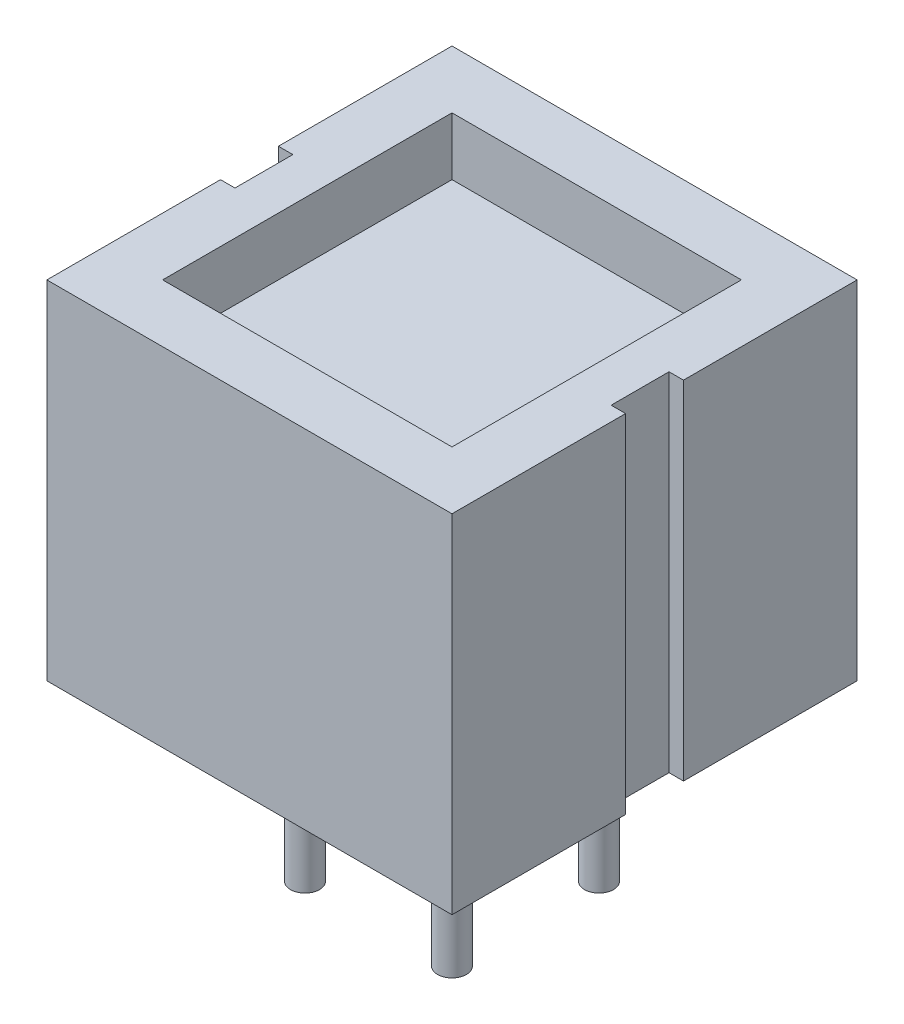
ISO-10303-21;
HEADER;
FILE_DESCRIPTION(('STEP AP214'),'2;1');
FILE_NAME('part.step','',(''),(''),'','','');
FILE_SCHEMA(('AUTOMOTIVE_DESIGN { 1 0 10303 214 1 1 1 1 }'));
ENDSEC;
DATA;
#1=APPLICATION_CONTEXT('core data for automotive mechanical design processes');
#2=APPLICATION_PROTOCOL_DEFINITION('international standard','automotive_design',2000,#1);
#3=PRODUCT_CONTEXT('',#1,'mechanical');
#4=PRODUCT('Part','Part','',(#3));
#5=PRODUCT_RELATED_PRODUCT_CATEGORY('part','',(#4));
#6=PRODUCT_DEFINITION_FORMATION('','',#4);
#7=PRODUCT_DEFINITION_CONTEXT('part definition',#1,'design');
#8=PRODUCT_DEFINITION('design','',#6,#7);
#9=PRODUCT_DEFINITION_SHAPE('','',#8);
#10=(LENGTH_UNIT() NAMED_UNIT(*) SI_UNIT(.MILLI.,.METRE.));
#11=(NAMED_UNIT(*) PLANE_ANGLE_UNIT() SI_UNIT($,.RADIAN.));
#12=(NAMED_UNIT(*) SI_UNIT($,.STERADIAN.) SOLID_ANGLE_UNIT());
#13=UNCERTAINTY_MEASURE_WITH_UNIT(LENGTH_MEASURE(1.E-05),#10,'distance_accuracy_value','');
#14=(GEOMETRIC_REPRESENTATION_CONTEXT(3) GLOBAL_UNCERTAINTY_ASSIGNED_CONTEXT((#13)) GLOBAL_UNIT_ASSIGNED_CONTEXT((#10,
#11,#12)) REPRESENTATION_CONTEXT('',''));
#15=CARTESIAN_POINT('',(0.,0.,0.));
#16=DIRECTION('',(0.,0.,1.));
#17=DIRECTION('',(1.,0.,0.));
#18=AXIS2_PLACEMENT_3D('',#15,#16,#17);
#19=CARTESIAN_POINT('',(3.5,6.,3.5));
#20=DIRECTION('',(-1.,0.,0.));
#21=DIRECTION('',(0.,0.,1.));
#22=AXIS2_PLACEMENT_3D('',#19,#20,#21);
#23=PLANE('',#22);
#24=DIRECTION('',(0.,0.,-1.));
#25=VECTOR('',#24,1.);
#26=CARTESIAN_POINT('',(3.5,6.,3.5));
#27=LINE('',#26,#25);
#28=CARTESIAN_POINT('',(3.5,6.,-0.5));
#29=VERTEX_POINT('',#28);
#30=CARTESIAN_POINT('',(3.5,6.,-3.5));
#31=VERTEX_POINT('',#30);
#32=EDGE_CURVE('E248',#29,#31,#27,.T.);
#33=ORIENTED_EDGE('',*,*,#32,.F.);
#34=DIRECTION('',(0.,-1.,0.));
#35=VECTOR('',#34,1.);
#36=CARTESIAN_POINT('',(3.5,6.,-0.5));
#37=LINE('',#36,#35);
#38=CARTESIAN_POINT('',(3.5,0.,-0.5));
#39=VERTEX_POINT('',#38);
#40=EDGE_CURVE('E186',#29,#39,#37,.T.);
#41=ORIENTED_EDGE('',*,*,#40,.T.);
#42=DIRECTION('',(0.,0.,-1.));
#43=VECTOR('',#42,1.);
#44=CARTESIAN_POINT('',(3.5,0.,3.5));
#45=LINE('',#44,#43);
#46=CARTESIAN_POINT('',(3.5,0.,-3.5));
#47=VERTEX_POINT('',#46);
#48=EDGE_CURVE('E243',#39,#47,#45,.T.);
#49=ORIENTED_EDGE('',*,*,#48,.T.);
#50=DIRECTION('',(0.,-1.,0.));
#51=VECTOR('',#50,1.);
#52=CARTESIAN_POINT('',(3.5,6.,-3.5));
#53=LINE('',#52,#51);
#54=EDGE_CURVE('E276',#31,#47,#53,.T.);
#55=ORIENTED_EDGE('',*,*,#54,.F.);
#56=EDGE_LOOP('',(#33,#41,#49,#55));
#57=FACE_BOUND('',#56,.T.);
#58=ADVANCED_FACE('F32',(#57),#23,.F.);
#59=CARTESIAN_POINT('',(-3.5,6.,3.5));
#60=DIRECTION('',(1.,0.,0.));
#61=DIRECTION('',(0.,0.,-1.));
#62=AXIS2_PLACEMENT_3D('',#59,#60,#61);
#63=PLANE('',#62);
#64=DIRECTION('',(0.,0.,1.));
#65=VECTOR('',#64,1.);
#66=CARTESIAN_POINT('',(-3.5,0.,3.5));
#67=LINE('',#66,#65);
#68=CARTESIAN_POINT('',(-3.5,0.,-3.5));
#69=VERTEX_POINT('',#68);
#70=CARTESIAN_POINT('',(-3.5,0.,-0.5));
#71=VERTEX_POINT('',#70);
#72=EDGE_CURVE('E263',#69,#71,#67,.T.);
#73=ORIENTED_EDGE('',*,*,#72,.T.);
#74=DIRECTION('',(0.,1.,0.));
#75=VECTOR('',#74,1.);
#76=CARTESIAN_POINT('',(-3.5,6.,-0.5));
#77=LINE('',#76,#75);
#78=CARTESIAN_POINT('',(-3.5,6.,-0.5));
#79=VERTEX_POINT('',#78);
#80=EDGE_CURVE('E182',#71,#79,#77,.T.);
#81=ORIENTED_EDGE('',*,*,#80,.T.);
#82=DIRECTION('',(0.,0.,1.));
#83=VECTOR('',#82,1.);
#84=CARTESIAN_POINT('',(-3.5,6.,3.5));
#85=LINE('',#84,#83);
#86=CARTESIAN_POINT('',(-3.5,6.,-3.5));
#87=VERTEX_POINT('',#86);
#88=EDGE_CURVE('E251',#87,#79,#85,.T.);
#89=ORIENTED_EDGE('',*,*,#88,.F.);
#90=DIRECTION('',(0.,-1.,0.));
#91=VECTOR('',#90,1.);
#92=CARTESIAN_POINT('',(-3.5,6.,-3.5));
#93=LINE('',#92,#91);
#94=EDGE_CURVE('E273',#87,#69,#93,.T.);
#95=ORIENTED_EDGE('',*,*,#94,.T.);
#96=EDGE_LOOP('',(#73,#81,#89,#95));
#97=FACE_BOUND('',#96,.T.);
#98=ADVANCED_FACE('F303',(#97),#63,.F.);
#99=CARTESIAN_POINT('',(3.5,0.,3.5));
#100=VERTEX_POINT('',#99);
#101=CARTESIAN_POINT('',(3.5,0.,0.5));
#102=VERTEX_POINT('',#101);
#103=EDGE_CURVE('E257',#100,#102,#45,.T.);
#104=ORIENTED_EDGE('',*,*,#103,.T.);
#105=DIRECTION('',(0.,1.,0.));
#106=VECTOR('',#105,1.);
#107=CARTESIAN_POINT('',(3.5,6.,0.5));
#108=LINE('',#107,#106);
#109=CARTESIAN_POINT('',(3.5,6.,0.5));
#110=VERTEX_POINT('',#109);
#111=EDGE_CURVE('E55',#102,#110,#108,.T.);
#112=ORIENTED_EDGE('',*,*,#111,.T.);
#113=CARTESIAN_POINT('',(3.5,6.,3.5));
#114=VERTEX_POINT('',#113);
#115=EDGE_CURVE('E165',#114,#110,#27,.T.);
#116=ORIENTED_EDGE('',*,*,#115,.F.);
#117=DIRECTION('',(0.,-1.,0.));
#118=VECTOR('',#117,1.);
#119=CARTESIAN_POINT('',(3.5,6.,3.5));
#120=LINE('',#119,#118);
#121=EDGE_CURVE('E256',#114,#100,#120,.T.);
#122=ORIENTED_EDGE('',*,*,#121,.T.);
#123=EDGE_LOOP('',(#104,#112,#116,#122));
#124=FACE_BOUND('',#123,.T.);
#125=ADVANCED_FACE('F34',(#124),#23,.F.);
#126=CARTESIAN_POINT('',(-3.5,6.,-3.5));
#127=DIRECTION('',(0.,0.,1.));
#128=DIRECTION('',(1.,0.,0.));
#129=AXIS2_PLACEMENT_3D('',#126,#127,#128);
#130=PLANE('',#129);
#131=DIRECTION('',(-1.,0.,0.));
#132=VECTOR('',#131,1.);
#133=CARTESIAN_POINT('',(-3.5,0.,-3.5));
#134=LINE('',#133,#132);
#135=EDGE_CURVE('E260',#47,#69,#134,.T.);
#136=ORIENTED_EDGE('',*,*,#135,.T.);
#137=ORIENTED_EDGE('',*,*,#94,.F.);
#138=DIRECTION('',(-1.,0.,0.));
#139=VECTOR('',#138,1.);
#140=CARTESIAN_POINT('',(-3.5,6.,-3.5));
#141=LINE('',#140,#139);
#142=EDGE_CURVE('E247',#31,#87,#141,.T.);
#143=ORIENTED_EDGE('',*,*,#142,.F.);
#144=ORIENTED_EDGE('',*,*,#54,.T.);
#145=EDGE_LOOP('',(#136,#137,#143,#144));
#146=FACE_BOUND('',#145,.T.);
#147=ADVANCED_FACE('F300',(#146),#130,.F.);
#148=CARTESIAN_POINT('',(-3.5,6.,0.5));
#149=VERTEX_POINT('',#148);
#150=CARTESIAN_POINT('',(-3.5,6.,3.5));
#151=VERTEX_POINT('',#150);
#152=EDGE_CURVE('E250',#149,#151,#85,.T.);
#153=ORIENTED_EDGE('',*,*,#152,.F.);
#154=DIRECTION('',(0.,-1.,0.));
#155=VECTOR('',#154,1.);
#156=CARTESIAN_POINT('',(-3.5,6.,0.5));
#157=LINE('',#156,#155);
#158=CARTESIAN_POINT('',(-3.5,0.,0.5));
#159=VERTEX_POINT('',#158);
#160=EDGE_CURVE('E169',#149,#159,#157,.T.);
#161=ORIENTED_EDGE('',*,*,#160,.T.);
#162=CARTESIAN_POINT('',(-3.5,0.,3.5));
#163=VERTEX_POINT('',#162);
#164=EDGE_CURVE('E262',#159,#163,#67,.T.);
#165=ORIENTED_EDGE('',*,*,#164,.T.);
#166=DIRECTION('',(0.,-1.,0.));
#167=VECTOR('',#166,1.);
#168=CARTESIAN_POINT('',(-3.5,6.,3.5));
#169=LINE('',#168,#167);
#170=EDGE_CURVE('E270',#151,#163,#169,.T.);
#171=ORIENTED_EDGE('',*,*,#170,.F.);
#172=EDGE_LOOP('',(#153,#161,#165,#171));
#173=FACE_BOUND('',#172,.T.);
#174=ADVANCED_FACE('F319',(#173),#63,.F.);
#175=CARTESIAN_POINT('',(-3.5,6.,3.5));
#176=DIRECTION('',(0.,0.,-1.));
#177=DIRECTION('',(-1.,0.,0.));
#178=AXIS2_PLACEMENT_3D('',#175,#176,#177);
#179=PLANE('',#178);
#180=DIRECTION('',(1.,0.,0.));
#181=VECTOR('',#180,1.);
#182=CARTESIAN_POINT('',(-3.5,0.,3.5));
#183=LINE('',#182,#181);
#184=EDGE_CURVE('E266',#163,#100,#183,.T.);
#185=ORIENTED_EDGE('',*,*,#184,.T.);
#186=ORIENTED_EDGE('',*,*,#121,.F.);
#187=DIRECTION('',(1.,0.,0.));
#188=VECTOR('',#187,1.);
#189=CARTESIAN_POINT('',(-3.5,6.,3.5));
#190=LINE('',#189,#188);
#191=EDGE_CURVE('E254',#151,#114,#190,.T.);
#192=ORIENTED_EDGE('',*,*,#191,.F.);
#193=ORIENTED_EDGE('',*,*,#170,.T.);
#194=EDGE_LOOP('',(#185,#186,#192,#193));
#195=FACE_BOUND('',#194,.T.);
#196=ADVANCED_FACE('F325',(#195),#179,.F.);
#197=CARTESIAN_POINT('',(0.,6.,0.));
#198=DIRECTION('',(0.,-1.,0.));
#199=DIRECTION('',(0.,0.,-1.));
#200=AXIS2_PLACEMENT_3D('',#197,#198,#199);
#201=PLANE('',#200);
#202=DIRECTION('',(-1.,0.,0.));
#203=VECTOR('',#202,1.);
#204=CARTESIAN_POINT('',(-2.5,6.,-2.5));
#205=LINE('',#204,#203);
#206=CARTESIAN_POINT('',(2.5,6.,-2.5));
#207=VERTEX_POINT('',#206);
#208=CARTESIAN_POINT('',(-2.5,6.,-2.5));
#209=VERTEX_POINT('',#208);
#210=EDGE_CURVE('E205',#207,#209,#205,.T.);
#211=ORIENTED_EDGE('',*,*,#210,.F.);
#212=DIRECTION('',(0.,0.,-1.));
#213=VECTOR('',#212,1.);
#214=CARTESIAN_POINT('',(2.5,6.,2.5));
#215=LINE('',#214,#213);
#216=CARTESIAN_POINT('',(2.5,6.,2.5));
#217=VERTEX_POINT('',#216);
#218=EDGE_CURVE('E189',#217,#207,#215,.T.);
#219=ORIENTED_EDGE('',*,*,#218,.F.);
#220=DIRECTION('',(1.,0.,0.));
#221=VECTOR('',#220,1.);
#222=CARTESIAN_POINT('',(-2.5,6.,2.5));
#223=LINE('',#222,#221);
#224=CARTESIAN_POINT('',(-2.5,6.,2.5));
#225=VERTEX_POINT('',#224);
#226=EDGE_CURVE('E194',#225,#217,#223,.T.);
#227=ORIENTED_EDGE('',*,*,#226,.F.);
#228=DIRECTION('',(0.,0.,1.));
#229=VECTOR('',#228,1.);
#230=CARTESIAN_POINT('',(-2.5,6.,2.5));
#231=LINE('',#230,#229);
#232=EDGE_CURVE('E208',#209,#225,#231,.T.);
#233=ORIENTED_EDGE('',*,*,#232,.F.);
#234=EDGE_LOOP('',(#211,#219,#227,#233));
#235=FACE_BOUND('',#234,.T.);
#236=DIRECTION('',(0.,0.,1.));
#237=VECTOR('',#236,1.);
#238=CARTESIAN_POINT('',(3.25,6.,0.5));
#239=LINE('',#238,#237);
#240=CARTESIAN_POINT('',(3.25,6.,-0.5));
#241=VERTEX_POINT('',#240);
#242=CARTESIAN_POINT('',(3.25,6.,0.5));
#243=VERTEX_POINT('',#242);
#244=EDGE_CURVE('E154',#241,#243,#239,.T.);
#245=ORIENTED_EDGE('',*,*,#244,.F.);
#246=DIRECTION('',(-1.,0.,0.));
#247=VECTOR('',#246,1.);
#248=CARTESIAN_POINT('',(3.75,6.,-0.5));
#249=LINE('',#248,#247);
#250=EDGE_CURVE('E151',#29,#241,#249,.T.);
#251=ORIENTED_EDGE('',*,*,#250,.F.);
#252=ORIENTED_EDGE('',*,*,#32,.T.);
#253=ORIENTED_EDGE('',*,*,#142,.T.);
#254=ORIENTED_EDGE('',*,*,#88,.T.);
#255=DIRECTION('',(-1.,0.,0.));
#256=VECTOR('',#255,1.);
#257=CARTESIAN_POINT('',(-3.75,6.,-0.5));
#258=LINE('',#257,#256);
#259=CARTESIAN_POINT('',(-3.25,6.,-0.5));
#260=VERTEX_POINT('',#259);
#261=EDGE_CURVE('E176',#260,#79,#258,.T.);
#262=ORIENTED_EDGE('',*,*,#261,.F.);
#263=DIRECTION('',(0.,0.,-1.));
#264=VECTOR('',#263,1.);
#265=CARTESIAN_POINT('',(-3.25,6.,0.5));
#266=LINE('',#265,#264);
#267=CARTESIAN_POINT('',(-3.25,6.,0.5));
#268=VERTEX_POINT('',#267);
#269=EDGE_CURVE('E173',#268,#260,#266,.T.);
#270=ORIENTED_EDGE('',*,*,#269,.F.);
#271=DIRECTION('',(1.,0.,0.));
#272=VECTOR('',#271,1.);
#273=CARTESIAN_POINT('',(-3.75,6.,0.5));
#274=LINE('',#273,#272);
#275=EDGE_CURVE('E171',#149,#268,#274,.T.);
#276=ORIENTED_EDGE('',*,*,#275,.F.);
#277=ORIENTED_EDGE('',*,*,#152,.T.);
#278=ORIENTED_EDGE('',*,*,#191,.T.);
#279=ORIENTED_EDGE('',*,*,#115,.T.);
#280=DIRECTION('',(1.,0.,0.));
#281=VECTOR('',#280,1.);
#282=CARTESIAN_POINT('',(3.75,6.,0.5));
#283=LINE('',#282,#281);
#284=EDGE_CURVE('E146',#243,#110,#283,.T.);
#285=ORIENTED_EDGE('',*,*,#284,.F.);
#286=EDGE_LOOP('',(#245,#251,#252,#253,#254,#262,#270,#276,#277,#278,#279,#285));
#287=FACE_BOUND('',#286,.T.);
#288=ADVANCED_FACE('F163',(#235,#287),#201,.F.);
#289=CARTESIAN_POINT('',(0.,0.,0.));
#290=DIRECTION('',(0.,-1.,0.));
#291=DIRECTION('',(0.,0.,-1.));
#292=AXIS2_PLACEMENT_3D('',#289,#290,#291);
#293=PLANE('',#292);
#294=DIRECTION('',(1.,0.,0.));
#295=VECTOR('',#294,1.);
#296=CARTESIAN_POINT('',(0.,0.,-0.499999999999999));
#297=LINE('',#296,#295);
#298=CARTESIAN_POINT('',(3.25,0.,-0.5));
#299=VERTEX_POINT('',#298);
#300=EDGE_CURVE('E11',#299,#39,#297,.T.);
#301=ORIENTED_EDGE('',*,*,#300,.F.);
#302=DIRECTION('',(0.,0.,-1.));
#303=VECTOR('',#302,1.);
#304=CARTESIAN_POINT('',(3.25,0.,0.));
#305=LINE('',#304,#303);
#306=CARTESIAN_POINT('',(3.25,0.,0.5));
#307=VERTEX_POINT('',#306);
#308=EDGE_CURVE('E40',#307,#299,#305,.T.);
#309=ORIENTED_EDGE('',*,*,#308,.F.);
#310=DIRECTION('',(-1.,0.,0.));
#311=VECTOR('',#310,1.);
#312=CARTESIAN_POINT('',(0.,0.,0.500000000000001));
#313=LINE('',#312,#311);
#314=EDGE_CURVE('E147',#102,#307,#313,.T.);
#315=ORIENTED_EDGE('',*,*,#314,.F.);
#316=ORIENTED_EDGE('',*,*,#103,.F.);
#317=ORIENTED_EDGE('',*,*,#184,.F.);
#318=ORIENTED_EDGE('',*,*,#164,.F.);
#319=DIRECTION('',(-1.,0.,0.));
#320=VECTOR('',#319,1.);
#321=CARTESIAN_POINT('',(0.,0.,0.500000000000001));
#322=LINE('',#321,#320);
#323=CARTESIAN_POINT('',(-3.25,0.,0.5));
#324=VERTEX_POINT('',#323);
#325=EDGE_CURVE('E279',#324,#159,#322,.T.);
#326=ORIENTED_EDGE('',*,*,#325,.F.);
#327=DIRECTION('',(0.,0.,1.));
#328=VECTOR('',#327,1.);
#329=CARTESIAN_POINT('',(-3.25,0.,0.));
#330=LINE('',#329,#328);
#331=CARTESIAN_POINT('',(-3.25,0.,-0.5));
#332=VERTEX_POINT('',#331);
#333=EDGE_CURVE('E281',#332,#324,#330,.T.);
#334=ORIENTED_EDGE('',*,*,#333,.F.);
#335=DIRECTION('',(1.,0.,0.));
#336=VECTOR('',#335,1.);
#337=CARTESIAN_POINT('',(0.,0.,-0.499999999999999));
#338=LINE('',#337,#336);
#339=EDGE_CURVE('E283',#71,#332,#338,.T.);
#340=ORIENTED_EDGE('',*,*,#339,.F.);
#341=ORIENTED_EDGE('',*,*,#72,.F.);
#342=ORIENTED_EDGE('',*,*,#135,.F.);
#343=ORIENTED_EDGE('',*,*,#48,.F.);
#344=EDGE_LOOP('',(#301,#309,#315,#316,#317,#318,#326,#334,#340,#341,#342,#343));
#345=FACE_BOUND('',#344,.T.);
#346=CARTESIAN_POINT('',(-1.27,0.,-1.27));
#347=DIRECTION('',(0.,-1.,0.));
#348=DIRECTION('',(0.,0.,-1.));
#349=AXIS2_PLACEMENT_3D('',#346,#347,#348);
#350=CIRCLE('',#349,0.25);
#351=CARTESIAN_POINT('',(-1.27,0.,-1.52));
#352=VERTEX_POINT('',#351);
#353=EDGE_CURVE('E215',#352,#352,#350,.T.);
#354=ORIENTED_EDGE('',*,*,#353,.F.);
#355=EDGE_LOOP('',(#354));
#356=FACE_BOUND('',#355,.T.);
#357=CARTESIAN_POINT('',(1.27,0.,1.27));
#358=DIRECTION('',(0.,-1.,0.));
#359=DIRECTION('',(0.,0.,-1.));
#360=AXIS2_PLACEMENT_3D('',#357,#358,#359);
#361=CIRCLE('',#360,0.25);
#362=CARTESIAN_POINT('',(1.27,0.,1.02));
#363=VERTEX_POINT('',#362);
#364=EDGE_CURVE('E225',#363,#363,#361,.T.);
#365=ORIENTED_EDGE('',*,*,#364,.F.);
#366=EDGE_LOOP('',(#365));
#367=FACE_BOUND('',#366,.T.);
#368=CARTESIAN_POINT('',(1.27,0.,-1.27));
#369=DIRECTION('',(0.,-1.,0.));
#370=DIRECTION('',(0.,0.,-1.));
#371=AXIS2_PLACEMENT_3D('',#368,#369,#370);
#372=CIRCLE('',#371,0.25);
#373=CARTESIAN_POINT('',(1.27,0.,-1.52));
#374=VERTEX_POINT('',#373);
#375=EDGE_CURVE('E231',#374,#374,#372,.T.);
#376=ORIENTED_EDGE('',*,*,#375,.F.);
#377=EDGE_LOOP('',(#376));
#378=FACE_BOUND('',#377,.T.);
#379=CARTESIAN_POINT('',(-1.27,0.,1.27));
#380=DIRECTION('',(0.,-1.,0.));
#381=DIRECTION('',(0.,0.,-1.));
#382=AXIS2_PLACEMENT_3D('',#379,#380,#381);
#383=CIRCLE('',#382,0.25);
#384=CARTESIAN_POINT('',(-1.27,0.,1.02));
#385=VERTEX_POINT('',#384);
#386=EDGE_CURVE('E237',#385,#385,#383,.T.);
#387=ORIENTED_EDGE('',*,*,#386,.F.);
#388=EDGE_LOOP('',(#387));
#389=FACE_BOUND('',#388,.T.);
#390=ADVANCED_FACE('F290',(#345,#356,#367,#378,#389),#293,.T.);
#391=CARTESIAN_POINT('',(-1.27,-3.,1.27));
#392=DIRECTION('',(0.,1.,0.));
#393=DIRECTION('',(0.,0.,1.));
#394=AXIS2_PLACEMENT_3D('',#391,#392,#393);
#395=CYLINDRICAL_SURFACE('',#394,0.25);
#396=CARTESIAN_POINT('',(-1.27,-3.,1.27));
#397=DIRECTION('',(0.,-1.,0.));
#398=DIRECTION('',(0.,0.,-1.));
#399=AXIS2_PLACEMENT_3D('',#396,#397,#398);
#400=CIRCLE('',#399,0.25);
#401=CARTESIAN_POINT('',(-1.27,-3.,1.02));
#402=VERTEX_POINT('',#401);
#403=EDGE_CURVE('E240',#402,#402,#400,.T.);
#404=ORIENTED_EDGE('',*,*,#403,.F.);
#405=EDGE_LOOP('',(#404));
#406=FACE_BOUND('',#405,.T.);
#407=ORIENTED_EDGE('',*,*,#386,.T.);
#408=EDGE_LOOP('',(#407));
#409=FACE_BOUND('',#408,.T.);
#410=ADVANCED_FACE('F375',(#406,#409),#395,.T.);
#411=CARTESIAN_POINT('',(-1.27,-3.,1.27));
#412=DIRECTION('',(0.,-1.,0.));
#413=DIRECTION('',(0.,0.,-1.));
#414=AXIS2_PLACEMENT_3D('',#411,#412,#413);
#415=PLANE('',#414);
#416=ORIENTED_EDGE('',*,*,#403,.T.);
#417=EDGE_LOOP('',(#416));
#418=FACE_BOUND('',#417,.T.);
#419=ADVANCED_FACE('F473',(#418),#415,.T.);
#420=CARTESIAN_POINT('',(1.27,-3.,-1.27));
#421=DIRECTION('',(0.,1.,0.));
#422=DIRECTION('',(0.,0.,1.));
#423=AXIS2_PLACEMENT_3D('',#420,#421,#422);
#424=CYLINDRICAL_SURFACE('',#423,0.25);
#425=CARTESIAN_POINT('',(1.27,-3.,-1.27));
#426=DIRECTION('',(0.,-1.,0.));
#427=DIRECTION('',(0.,0.,-1.));
#428=AXIS2_PLACEMENT_3D('',#425,#426,#427);
#429=CIRCLE('',#428,0.25);
#430=CARTESIAN_POINT('',(1.27,-3.,-1.52));
#431=VERTEX_POINT('',#430);
#432=EDGE_CURVE('E234',#431,#431,#429,.T.);
#433=ORIENTED_EDGE('',*,*,#432,.F.);
#434=EDGE_LOOP('',(#433));
#435=FACE_BOUND('',#434,.T.);
#436=ORIENTED_EDGE('',*,*,#375,.T.);
#437=EDGE_LOOP('',(#436));
#438=FACE_BOUND('',#437,.T.);
#439=ADVANCED_FACE('F469',(#435,#438),#424,.T.);
#440=CARTESIAN_POINT('',(1.27,-3.,-1.27));
#441=DIRECTION('',(0.,-1.,0.));
#442=DIRECTION('',(0.,0.,-1.));
#443=AXIS2_PLACEMENT_3D('',#440,#441,#442);
#444=PLANE('',#443);
#445=ORIENTED_EDGE('',*,*,#432,.T.);
#446=EDGE_LOOP('',(#445));
#447=FACE_BOUND('',#446,.T.);
#448=ADVANCED_FACE('F465',(#447),#444,.T.);
#449=CARTESIAN_POINT('',(1.27,-3.,1.27));
#450=DIRECTION('',(0.,1.,0.));
#451=DIRECTION('',(0.,0.,1.));
#452=AXIS2_PLACEMENT_3D('',#449,#450,#451);
#453=CYLINDRICAL_SURFACE('',#452,0.25);
#454=CARTESIAN_POINT('',(1.27,-3.,1.27));
#455=DIRECTION('',(0.,-1.,0.));
#456=DIRECTION('',(0.,0.,-1.));
#457=AXIS2_PLACEMENT_3D('',#454,#455,#456);
#458=CIRCLE('',#457,0.25);
#459=CARTESIAN_POINT('',(1.27,-3.,1.02));
#460=VERTEX_POINT('',#459);
#461=EDGE_CURVE('E228',#460,#460,#458,.T.);
#462=ORIENTED_EDGE('',*,*,#461,.F.);
#463=EDGE_LOOP('',(#462));
#464=FACE_BOUND('',#463,.T.);
#465=ORIENTED_EDGE('',*,*,#364,.T.);
#466=EDGE_LOOP('',(#465));
#467=FACE_BOUND('',#466,.T.);
#468=ADVANCED_FACE('F461',(#464,#467),#453,.T.);
#469=CARTESIAN_POINT('',(1.27,-3.,1.27));
#470=DIRECTION('',(0.,-1.,0.));
#471=DIRECTION('',(0.,0.,-1.));
#472=AXIS2_PLACEMENT_3D('',#469,#470,#471);
#473=PLANE('',#472);
#474=ORIENTED_EDGE('',*,*,#461,.T.);
#475=EDGE_LOOP('',(#474));
#476=FACE_BOUND('',#475,.T.);
#477=ADVANCED_FACE('F457',(#476),#473,.T.);
#478=CARTESIAN_POINT('',(-1.27,-3.,-1.27));
#479=DIRECTION('',(0.,1.,0.));
#480=DIRECTION('',(0.,0.,1.));
#481=AXIS2_PLACEMENT_3D('',#478,#479,#480);
#482=CYLINDRICAL_SURFACE('',#481,0.25);
#483=CARTESIAN_POINT('',(-1.27,-3.,-1.27));
#484=DIRECTION('',(0.,-1.,0.));
#485=DIRECTION('',(0.,0.,-1.));
#486=AXIS2_PLACEMENT_3D('',#483,#484,#485);
#487=CIRCLE('',#486,0.25);
#488=CARTESIAN_POINT('',(-1.27,-3.,-1.52));
#489=VERTEX_POINT('',#488);
#490=EDGE_CURVE('E222',#489,#489,#487,.T.);
#491=ORIENTED_EDGE('',*,*,#490,.F.);
#492=EDGE_LOOP('',(#491));
#493=FACE_BOUND('',#492,.T.);
#494=ORIENTED_EDGE('',*,*,#353,.T.);
#495=EDGE_LOOP('',(#494));
#496=FACE_BOUND('',#495,.T.);
#497=ADVANCED_FACE('F453',(#493,#496),#482,.T.);
#498=CARTESIAN_POINT('',(-1.27,-3.,-1.27));
#499=DIRECTION('',(0.,-1.,0.));
#500=DIRECTION('',(0.,0.,-1.));
#501=AXIS2_PLACEMENT_3D('',#498,#499,#500);
#502=PLANE('',#501);
#503=ORIENTED_EDGE('',*,*,#490,.T.);
#504=EDGE_LOOP('',(#503));
#505=FACE_BOUND('',#504,.T.);
#506=ADVANCED_FACE('F449',(#505),#502,.T.);
#507=CARTESIAN_POINT('',(2.5,5.,2.5));
#508=DIRECTION('',(1.,0.,0.));
#509=DIRECTION('',(0.,0.,-1.));
#510=AXIS2_PLACEMENT_3D('',#507,#508,#509);
#511=PLANE('',#510);
#512=ORIENTED_EDGE('',*,*,#218,.T.);
#513=DIRECTION('',(0.,1.,0.));
#514=VECTOR('',#513,1.);
#515=CARTESIAN_POINT('',(2.5,5.,-2.5));
#516=LINE('',#515,#514);
#517=CARTESIAN_POINT('',(2.5,5.,-2.5));
#518=VERTEX_POINT('',#517);
#519=EDGE_CURVE('E203',#518,#207,#516,.T.);
#520=ORIENTED_EDGE('',*,*,#519,.F.);
#521=DIRECTION('',(0.,0.,-1.));
#522=VECTOR('',#521,1.);
#523=CARTESIAN_POINT('',(2.5,5.,2.5));
#524=LINE('',#523,#522);
#525=CARTESIAN_POINT('',(2.5,5.,2.5));
#526=VERTEX_POINT('',#525);
#527=EDGE_CURVE('E190',#526,#518,#524,.T.);
#528=ORIENTED_EDGE('',*,*,#527,.F.);
#529=DIRECTION('',(0.,1.,0.));
#530=VECTOR('',#529,1.);
#531=CARTESIAN_POINT('',(2.5,5.,2.5));
#532=LINE('',#531,#530);
#533=EDGE_CURVE('E213',#526,#217,#532,.T.);
#534=ORIENTED_EDGE('',*,*,#533,.T.);
#535=EDGE_LOOP('',(#512,#520,#528,#534));
#536=FACE_BOUND('',#535,.T.);
#537=ADVANCED_FACE('F439',(#536),#511,.F.);
#538=CARTESIAN_POINT('',(-2.5,5.,2.5));
#539=DIRECTION('',(0.,0.,1.));
#540=DIRECTION('',(1.,0.,0.));
#541=AXIS2_PLACEMENT_3D('',#538,#539,#540);
#542=PLANE('',#541);
#543=ORIENTED_EDGE('',*,*,#226,.T.);
#544=ORIENTED_EDGE('',*,*,#533,.F.);
#545=DIRECTION('',(1.,0.,0.));
#546=VECTOR('',#545,1.);
#547=CARTESIAN_POINT('',(-2.5,5.,2.5));
#548=LINE('',#547,#546);
#549=CARTESIAN_POINT('',(-2.5,5.,2.5));
#550=VERTEX_POINT('',#549);
#551=EDGE_CURVE('E200',#550,#526,#548,.T.);
#552=ORIENTED_EDGE('',*,*,#551,.F.);
#553=DIRECTION('',(0.,1.,0.));
#554=VECTOR('',#553,1.);
#555=CARTESIAN_POINT('',(-2.5,5.,2.5));
#556=LINE('',#555,#554);
#557=EDGE_CURVE('E216',#550,#225,#556,.T.);
#558=ORIENTED_EDGE('',*,*,#557,.T.);
#559=EDGE_LOOP('',(#543,#544,#552,#558));
#560=FACE_BOUND('',#559,.T.);
#561=ADVANCED_FACE('F435',(#560),#542,.F.);
#562=CARTESIAN_POINT('',(-2.5,5.,2.5));
#563=DIRECTION('',(-1.,0.,0.));
#564=DIRECTION('',(0.,0.,1.));
#565=AXIS2_PLACEMENT_3D('',#562,#563,#564);
#566=PLANE('',#565);
#567=ORIENTED_EDGE('',*,*,#232,.T.);
#568=ORIENTED_EDGE('',*,*,#557,.F.);
#569=DIRECTION('',(0.,0.,1.));
#570=VECTOR('',#569,1.);
#571=CARTESIAN_POINT('',(-2.5,5.,2.5));
#572=LINE('',#571,#570);
#573=CARTESIAN_POINT('',(-2.5,5.,-2.5));
#574=VERTEX_POINT('',#573);
#575=EDGE_CURVE('E197',#574,#550,#572,.T.);
#576=ORIENTED_EDGE('',*,*,#575,.F.);
#577=DIRECTION('',(0.,1.,0.));
#578=VECTOR('',#577,1.);
#579=CARTESIAN_POINT('',(-2.5,5.,-2.5));
#580=LINE('',#579,#578);
#581=EDGE_CURVE('E218',#574,#209,#580,.T.);
#582=ORIENTED_EDGE('',*,*,#581,.T.);
#583=EDGE_LOOP('',(#567,#568,#576,#582));
#584=FACE_BOUND('',#583,.T.);
#585=ADVANCED_FACE('F438',(#584),#566,.F.);
#586=CARTESIAN_POINT('',(-2.5,5.,-2.5));
#587=DIRECTION('',(0.,0.,-1.));
#588=DIRECTION('',(-1.,0.,0.));
#589=AXIS2_PLACEMENT_3D('',#586,#587,#588);
#590=PLANE('',#589);
#591=ORIENTED_EDGE('',*,*,#210,.T.);
#592=ORIENTED_EDGE('',*,*,#581,.F.);
#593=DIRECTION('',(-1.,0.,0.));
#594=VECTOR('',#593,1.);
#595=CARTESIAN_POINT('',(-2.5,5.,-2.5));
#596=LINE('',#595,#594);
#597=EDGE_CURVE('E193',#518,#574,#596,.T.);
#598=ORIENTED_EDGE('',*,*,#597,.F.);
#599=ORIENTED_EDGE('',*,*,#519,.T.);
#600=EDGE_LOOP('',(#591,#592,#598,#599));
#601=FACE_BOUND('',#600,.T.);
#602=ADVANCED_FACE('F433',(#601),#590,.F.);
#603=CARTESIAN_POINT('',(0.,5.,0.));
#604=DIRECTION('',(0.,-1.,0.));
#605=DIRECTION('',(0.,0.,-1.));
#606=AXIS2_PLACEMENT_3D('',#603,#604,#605);
#607=PLANE('',#606);
#608=ORIENTED_EDGE('',*,*,#527,.T.);
#609=ORIENTED_EDGE('',*,*,#597,.T.);
#610=ORIENTED_EDGE('',*,*,#575,.T.);
#611=ORIENTED_EDGE('',*,*,#551,.T.);
#612=EDGE_LOOP('',(#608,#609,#610,#611));
#613=FACE_BOUND('',#612,.T.);
#614=ADVANCED_FACE('F386',(#613),#607,.F.);
#615=CARTESIAN_POINT('',(-3.75,-3.,-0.5));
#616=DIRECTION('',(0.,0.,-1.));
#617=DIRECTION('',(-1.,0.,0.));
#618=AXIS2_PLACEMENT_3D('',#615,#616,#617);
#619=PLANE('',#618);
#620=ORIENTED_EDGE('',*,*,#339,.T.);
#621=DIRECTION('',(0.,1.,0.));
#622=VECTOR('',#621,1.);
#623=CARTESIAN_POINT('',(-3.25,-3.,-0.5));
#624=LINE('',#623,#622);
#625=EDGE_CURVE('E160',#332,#260,#624,.T.);
#626=ORIENTED_EDGE('',*,*,#625,.T.);
#627=ORIENTED_EDGE('',*,*,#261,.T.);
#628=ORIENTED_EDGE('',*,*,#80,.F.);
#629=EDGE_LOOP('',(#620,#626,#627,#628));
#630=FACE_BOUND('',#629,.T.);
#631=ADVANCED_FACE('F308',(#630),#619,.F.);
#632=CARTESIAN_POINT('',(-3.75,-3.,0.5));
#633=DIRECTION('',(0.,0.,1.));
#634=DIRECTION('',(1.,0.,0.));
#635=AXIS2_PLACEMENT_3D('',#632,#633,#634);
#636=PLANE('',#635);
#637=ORIENTED_EDGE('',*,*,#275,.T.);
#638=DIRECTION('',(0.,1.,0.));
#639=VECTOR('',#638,1.);
#640=CARTESIAN_POINT('',(-3.25,-3.,0.5));
#641=LINE('',#640,#639);
#642=EDGE_CURVE('E47',#324,#268,#641,.T.);
#643=ORIENTED_EDGE('',*,*,#642,.F.);
#644=ORIENTED_EDGE('',*,*,#325,.T.);
#645=ORIENTED_EDGE('',*,*,#160,.F.);
#646=EDGE_LOOP('',(#637,#643,#644,#645));
#647=FACE_BOUND('',#646,.T.);
#648=ADVANCED_FACE('F315',(#647),#636,.F.);
#649=CARTESIAN_POINT('',(-3.25,-3.,0.5));
#650=DIRECTION('',(1.,0.,0.));
#651=DIRECTION('',(0.,0.,-1.));
#652=AXIS2_PLACEMENT_3D('',#649,#650,#651);
#653=PLANE('',#652);
#654=ORIENTED_EDGE('',*,*,#333,.T.);
#655=ORIENTED_EDGE('',*,*,#642,.T.);
#656=ORIENTED_EDGE('',*,*,#269,.T.);
#657=ORIENTED_EDGE('',*,*,#625,.F.);
#658=EDGE_LOOP('',(#654,#655,#656,#657));
#659=FACE_BOUND('',#658,.T.);
#660=ADVANCED_FACE('F313',(#659),#653,.F.);
#661=CARTESIAN_POINT('',(3.75,-3.,-0.5));
#662=DIRECTION('',(0.,0.,-1.));
#663=DIRECTION('',(-1.,0.,0.));
#664=AXIS2_PLACEMENT_3D('',#661,#662,#663);
#665=PLANE('',#664);
#666=ORIENTED_EDGE('',*,*,#250,.T.);
#667=DIRECTION('',(0.,1.,0.));
#668=VECTOR('',#667,1.);
#669=CARTESIAN_POINT('',(3.25,-3.,-0.5));
#670=LINE('',#669,#668);
#671=EDGE_CURVE('E150',#299,#241,#670,.T.);
#672=ORIENTED_EDGE('',*,*,#671,.F.);
#673=ORIENTED_EDGE('',*,*,#300,.T.);
#674=ORIENTED_EDGE('',*,*,#40,.F.);
#675=EDGE_LOOP('',(#666,#672,#673,#674));
#676=FACE_BOUND('',#675,.T.);
#677=ADVANCED_FACE('F288',(#676),#665,.F.);
#678=CARTESIAN_POINT('',(3.75,-3.,0.5));
#679=DIRECTION('',(0.,0.,1.));
#680=DIRECTION('',(1.,0.,0.));
#681=AXIS2_PLACEMENT_3D('',#678,#679,#680);
#682=PLANE('',#681);
#683=ORIENTED_EDGE('',*,*,#314,.T.);
#684=DIRECTION('',(0.,1.,0.));
#685=VECTOR('',#684,1.);
#686=CARTESIAN_POINT('',(3.25,-3.,0.5));
#687=LINE('',#686,#685);
#688=EDGE_CURVE('E142',#307,#243,#687,.T.);
#689=ORIENTED_EDGE('',*,*,#688,.T.);
#690=ORIENTED_EDGE('',*,*,#284,.T.);
#691=ORIENTED_EDGE('',*,*,#111,.F.);
#692=EDGE_LOOP('',(#683,#689,#690,#691));
#693=FACE_BOUND('',#692,.T.);
#694=ADVANCED_FACE('F144',(#693),#682,.F.);
#695=CARTESIAN_POINT('',(3.25,-3.,0.5));
#696=DIRECTION('',(-1.,0.,0.));
#697=DIRECTION('',(0.,0.,1.));
#698=AXIS2_PLACEMENT_3D('',#695,#696,#697);
#699=PLANE('',#698);
#700=ORIENTED_EDGE('',*,*,#308,.T.);
#701=ORIENTED_EDGE('',*,*,#671,.T.);
#702=ORIENTED_EDGE('',*,*,#244,.T.);
#703=ORIENTED_EDGE('',*,*,#688,.F.);
#704=EDGE_LOOP('',(#700,#701,#702,#703));
#705=FACE_BOUND('',#704,.T.);
#706=ADVANCED_FACE('F155',(#705),#699,.F.);
#707=CLOSED_SHELL('',(#58,#98,#125,#147,#174,#196,#288,#390,#410,#419,#439,#448,#468,#477,#497,
#506,#537,#561,#585,#602,#614,#631,#648,#660,#677,#694,#706));
#708=MANIFOLD_SOLID_BREP('B2',#707);
#709=ADVANCED_BREP_SHAPE_REPRESENTATION('',(#18,#708),#14);
#710=SHAPE_DEFINITION_REPRESENTATION(#9,#709);
ENDSEC;
END-ISO-10303-21;
